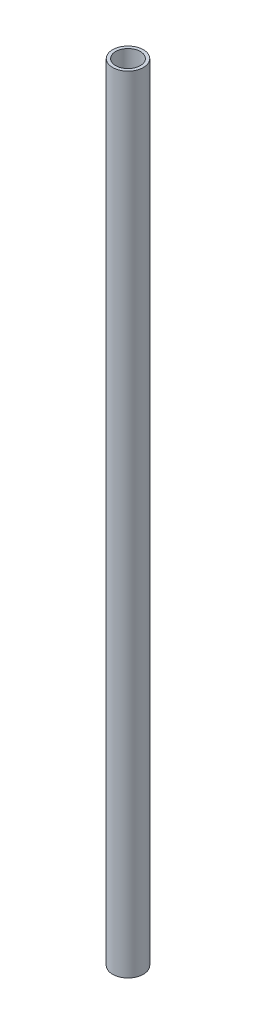
ISO-10303-21;
HEADER;
FILE_DESCRIPTION(('STEP AP214'),'2;1');
FILE_NAME('part.step','',(''),(''),'','','');
FILE_SCHEMA(('AUTOMOTIVE_DESIGN { 1 0 10303 214 1 1 1 1 }'));
ENDSEC;
DATA;
#1=APPLICATION_CONTEXT('core data for automotive mechanical design processes');
#2=APPLICATION_PROTOCOL_DEFINITION('international standard','automotive_design',2000,#1);
#3=PRODUCT_CONTEXT('',#1,'mechanical');
#4=PRODUCT('Part','Part','',(#3));
#5=PRODUCT_RELATED_PRODUCT_CATEGORY('part','',(#4));
#6=PRODUCT_DEFINITION_FORMATION('','',#4);
#7=PRODUCT_DEFINITION_CONTEXT('part definition',#1,'design');
#8=PRODUCT_DEFINITION('design','',#6,#7);
#9=PRODUCT_DEFINITION_SHAPE('','',#8);
#10=(LENGTH_UNIT() NAMED_UNIT(*) SI_UNIT(.MILLI.,.METRE.));
#11=(NAMED_UNIT(*) PLANE_ANGLE_UNIT() SI_UNIT($,.RADIAN.));
#12=(NAMED_UNIT(*) SI_UNIT($,.STERADIAN.) SOLID_ANGLE_UNIT());
#13=UNCERTAINTY_MEASURE_WITH_UNIT(LENGTH_MEASURE(1.E-05),#10,'distance_accuracy_value','');
#14=(GEOMETRIC_REPRESENTATION_CONTEXT(3) GLOBAL_UNCERTAINTY_ASSIGNED_CONTEXT((#13)) GLOBAL_UNIT_ASSIGNED_CONTEXT((#10,
#11,#12)) REPRESENTATION_CONTEXT('',''));
#15=CARTESIAN_POINT('',(0.,0.,0.));
#16=DIRECTION('',(0.,0.,1.));
#17=DIRECTION('',(1.,0.,0.));
#18=AXIS2_PLACEMENT_3D('',#15,#16,#17);
#19=CARTESIAN_POINT('',(0.,510.,0.));
#20=DIRECTION('',(0.,-1.,0.));
#21=DIRECTION('',(0.,0.,-1.));
#22=AXIS2_PLACEMENT_3D('',#19,#20,#21);
#23=CYLINDRICAL_SURFACE('',#22,10.);
#24=CARTESIAN_POINT('',(0.,510.,0.));
#25=DIRECTION('',(0.,1.,0.));
#26=DIRECTION('',(0.,0.,1.));
#27=AXIS2_PLACEMENT_3D('',#24,#25,#26);
#28=CIRCLE('',#27,10.);
#29=CARTESIAN_POINT('',(0.,510.,10.));
#30=VERTEX_POINT('',#29);
#31=EDGE_CURVE('E10',#30,#30,#28,.T.);
#32=ORIENTED_EDGE('',*,*,#31,.F.);
#33=EDGE_LOOP('',(#32));
#34=FACE_BOUND('',#33,.T.);
#35=CARTESIAN_POINT('',(0.,0.,0.));
#36=DIRECTION('',(0.,1.,0.));
#37=DIRECTION('',(0.,0.,1.));
#38=AXIS2_PLACEMENT_3D('',#35,#36,#37);
#39=CIRCLE('',#38,10.);
#40=CARTESIAN_POINT('',(0.,0.,10.));
#41=VERTEX_POINT('',#40);
#42=EDGE_CURVE('E40',#41,#41,#39,.T.);
#43=ORIENTED_EDGE('',*,*,#42,.T.);
#44=EDGE_LOOP('',(#43));
#45=FACE_BOUND('',#44,.T.);
#46=ADVANCED_FACE('F37',(#34,#45),#23,.T.);
#47=CARTESIAN_POINT('',(0.,510.,0.));
#48=DIRECTION('',(0.,1.,0.));
#49=DIRECTION('',(0.,0.,1.));
#50=AXIS2_PLACEMENT_3D('',#47,#48,#49);
#51=PLANE('',#50);
#52=CARTESIAN_POINT('',(0.,510.,0.));
#53=DIRECTION('',(0.,1.,0.));
#54=DIRECTION('',(0.,0.,1.));
#55=AXIS2_PLACEMENT_3D('',#52,#53,#54);
#56=CIRCLE('',#55,8.);
#57=CARTESIAN_POINT('',(0.,510.,8.));
#58=VERTEX_POINT('',#57);
#59=EDGE_CURVE('E49',#58,#58,#56,.T.);
#60=ORIENTED_EDGE('',*,*,#59,.F.);
#61=EDGE_LOOP('',(#60));
#62=FACE_BOUND('',#61,.T.);
#63=ORIENTED_EDGE('',*,*,#31,.T.);
#64=EDGE_LOOP('',(#63));
#65=FACE_BOUND('',#64,.T.);
#66=ADVANCED_FACE('F71',(#62,#65),#51,.T.);
#67=CARTESIAN_POINT('',(0.,0.,0.));
#68=DIRECTION('',(0.,1.,0.));
#69=DIRECTION('',(0.,0.,1.));
#70=AXIS2_PLACEMENT_3D('',#67,#68,#69);
#71=PLANE('',#70);
#72=ORIENTED_EDGE('',*,*,#42,.F.);
#73=EDGE_LOOP('',(#72));
#74=FACE_BOUND('',#73,.T.);
#75=ADVANCED_FACE('F63',(#74),#71,.F.);
#76=CARTESIAN_POINT('',(0.,510.,0.));
#77=DIRECTION('',(0.,-1.,0.));
#78=DIRECTION('',(0.,0.,-1.));
#79=AXIS2_PLACEMENT_3D('',#76,#77,#78);
#80=CYLINDRICAL_SURFACE('',#79,8.);
#81=ORIENTED_EDGE('',*,*,#59,.T.);
#82=EDGE_LOOP('',(#81));
#83=FACE_BOUND('',#82,.T.);
#84=CARTESIAN_POINT('',(0.,2.,0.));
#85=DIRECTION('',(0.,1.,0.));
#86=DIRECTION('',(0.,0.,1.));
#87=AXIS2_PLACEMENT_3D('',#84,#85,#86);
#88=CIRCLE('',#87,8.);
#89=CARTESIAN_POINT('',(0.,2.,8.));
#90=VERTEX_POINT('',#89);
#91=EDGE_CURVE('E54',#90,#90,#88,.T.);
#92=ORIENTED_EDGE('',*,*,#91,.F.);
#93=EDGE_LOOP('',(#92));
#94=FACE_BOUND('',#93,.T.);
#95=ADVANCED_FACE('F61',(#83,#94),#80,.F.);
#96=CARTESIAN_POINT('',(0.,2.,0.));
#97=DIRECTION('',(0.,1.,0.));
#98=DIRECTION('',(0.,0.,1.));
#99=AXIS2_PLACEMENT_3D('',#96,#97,#98);
#100=PLANE('',#99);
#101=ORIENTED_EDGE('',*,*,#91,.T.);
#102=EDGE_LOOP('',(#101));
#103=FACE_BOUND('',#102,.T.);
#104=ADVANCED_FACE('F59',(#103),#100,.T.);
#105=CLOSED_SHELL('',(#46,#66,#75,#95,#104));
#106=MANIFOLD_SOLID_BREP('B2',#105);
#107=ADVANCED_BREP_SHAPE_REPRESENTATION('',(#18,#106),#14);
#108=SHAPE_DEFINITION_REPRESENTATION(#9,#107);
ENDSEC;
END-ISO-10303-21;
